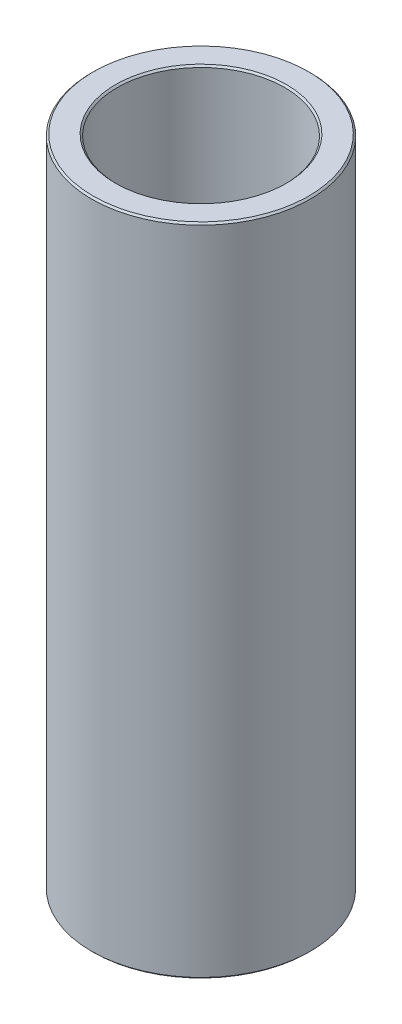
ISO-10303-21;
HEADER;
FILE_DESCRIPTION(('STEP AP214'),'2;1');
FILE_NAME('part.step','',(''),(''),'','','');
FILE_SCHEMA(('AUTOMOTIVE_DESIGN { 1 0 10303 214 1 1 1 1 }'));
ENDSEC;
DATA;
#1=APPLICATION_CONTEXT('core data for automotive mechanical design processes');
#2=APPLICATION_PROTOCOL_DEFINITION('international standard','automotive_design',2000,#1);
#3=PRODUCT_CONTEXT('',#1,'mechanical');
#4=PRODUCT('Part','Part','',(#3));
#5=PRODUCT_RELATED_PRODUCT_CATEGORY('part','',(#4));
#6=PRODUCT_DEFINITION_FORMATION('','',#4);
#7=PRODUCT_DEFINITION_CONTEXT('part definition',#1,'design');
#8=PRODUCT_DEFINITION('design','',#6,#7);
#9=PRODUCT_DEFINITION_SHAPE('','',#8);
#10=(LENGTH_UNIT() NAMED_UNIT(*) SI_UNIT(.MILLI.,.METRE.));
#11=(NAMED_UNIT(*) PLANE_ANGLE_UNIT() SI_UNIT($,.RADIAN.));
#12=(NAMED_UNIT(*) SI_UNIT($,.STERADIAN.) SOLID_ANGLE_UNIT());
#13=UNCERTAINTY_MEASURE_WITH_UNIT(LENGTH_MEASURE(1.E-05),#10,'distance_accuracy_value','');
#14=(GEOMETRIC_REPRESENTATION_CONTEXT(3) GLOBAL_UNCERTAINTY_ASSIGNED_CONTEXT((#13)) GLOBAL_UNIT_ASSIGNED_CONTEXT((#10,
#11,#12)) REPRESENTATION_CONTEXT('',''));
#15=CARTESIAN_POINT('',(0.,0.,0.));
#16=DIRECTION('',(0.,0.,1.));
#17=DIRECTION('',(1.,0.,0.));
#18=AXIS2_PLACEMENT_3D('',#15,#16,#17);
#19=CARTESIAN_POINT('',(0.,119.704415854471,0.));
#20=DIRECTION('',(0.,-1.,0.));
#21=DIRECTION('',(0.,0.,-1.));
#22=AXIS2_PLACEMENT_3D('',#19,#20,#21);
#23=CYLINDRICAL_SURFACE('',#22,20.);
#24=CARTESIAN_POINT('',(0.,0.311713244223147,0.));
#25=DIRECTION('',(0.,1.,0.));
#26=DIRECTION('',(0.,0.,1.));
#27=AXIS2_PLACEMENT_3D('',#24,#25,#26);
#28=CIRCLE('',#27,20.);
#29=CARTESIAN_POINT('',(0.,0.311713244223147,20.));
#30=VERTEX_POINT('',#29);
#31=EDGE_CURVE('E10',#30,#30,#28,.T.);
#32=ORIENTED_EDGE('',*,*,#31,.T.);
#33=EDGE_LOOP('',(#32));
#34=FACE_BOUND('',#33,.T.);
#35=CARTESIAN_POINT('',(0.,119.392702610247,0.));
#36=DIRECTION('',(0.,1.,0.));
#37=DIRECTION('',(0.,0.,1.));
#38=AXIS2_PLACEMENT_3D('',#35,#36,#37);
#39=CIRCLE('',#38,20.);
#40=CARTESIAN_POINT('',(0.,119.392702610247,20.));
#41=VERTEX_POINT('',#40);
#42=EDGE_CURVE('E50',#41,#41,#39,.F.);
#43=ORIENTED_EDGE('',*,*,#42,.T.);
#44=EDGE_LOOP('',(#43));
#45=FACE_BOUND('',#44,.T.);
#46=ADVANCED_FACE('F39',(#34,#45),#23,.T.);
#47=CARTESIAN_POINT('',(0.,119.704415854471,0.));
#48=DIRECTION('',(0.,1.,0.));
#49=DIRECTION('',(0.,0.,1.));
#50=AXIS2_PLACEMENT_3D('',#47,#48,#49);
#51=PLANE('',#50);
#52=CARTESIAN_POINT('',(0.,119.704415854471,0.));
#53=DIRECTION('',(0.,1.,0.));
#54=DIRECTION('',(0.,0.,1.));
#55=AXIS2_PLACEMENT_3D('',#52,#53,#54);
#56=CIRCLE('',#55,15.6331669486327);
#57=CARTESIAN_POINT('',(0.,119.704415854471,15.6331669486327));
#58=VERTEX_POINT('',#57);
#59=EDGE_CURVE('E58',#58,#58,#56,.F.);
#60=ORIENTED_EDGE('',*,*,#59,.T.);
#61=EDGE_LOOP('',(#60));
#62=FACE_BOUND('',#61,.T.);
#63=CARTESIAN_POINT('',(0.,119.704415854471,0.));
#64=DIRECTION('',(0.,1.,0.));
#65=DIRECTION('',(0.,0.,1.));
#66=AXIS2_PLACEMENT_3D('',#63,#64,#65);
#67=CIRCLE('',#66,19.6882867557768);
#68=CARTESIAN_POINT('',(0.,119.704415854471,19.6882867557768));
#69=VERTEX_POINT('',#68);
#70=EDGE_CURVE('E61',#69,#69,#67,.T.);
#71=ORIENTED_EDGE('',*,*,#70,.T.);
#72=EDGE_LOOP('',(#71));
#73=FACE_BOUND('',#72,.T.);
#74=ADVANCED_FACE('F88',(#62,#73),#51,.T.);
#75=CARTESIAN_POINT('',(0.,0.,0.));
#76=DIRECTION('',(0.,1.,0.));
#77=DIRECTION('',(0.,0.,1.));
#78=AXIS2_PLACEMENT_3D('',#75,#76,#77);
#79=PLANE('',#78);
#80=CARTESIAN_POINT('',(0.,0.,0.));
#81=DIRECTION('',(0.,1.,0.));
#82=DIRECTION('',(0.,0.,1.));
#83=AXIS2_PLACEMENT_3D('',#80,#81,#82);
#84=CIRCLE('',#83,15.6331669486327);
#85=CARTESIAN_POINT('',(0.,0.,15.6331669486327));
#86=VERTEX_POINT('',#85);
#87=EDGE_CURVE('E51',#86,#86,#84,.T.);
#88=ORIENTED_EDGE('',*,*,#87,.T.);
#89=EDGE_LOOP('',(#88));
#90=FACE_BOUND('',#89,.T.);
#91=CARTESIAN_POINT('',(0.,0.,0.));
#92=DIRECTION('',(0.,1.,0.));
#93=DIRECTION('',(0.,0.,1.));
#94=AXIS2_PLACEMENT_3D('',#91,#92,#93);
#95=CIRCLE('',#94,19.6882867557768);
#96=CARTESIAN_POINT('',(0.,0.,19.6882867557768));
#97=VERTEX_POINT('',#96);
#98=EDGE_CURVE('E54',#97,#97,#95,.F.);
#99=ORIENTED_EDGE('',*,*,#98,.T.);
#100=EDGE_LOOP('',(#99));
#101=FACE_BOUND('',#100,.T.);
#102=ADVANCED_FACE('F83',(#90,#101),#79,.F.);
#103=CARTESIAN_POINT('',(0.,119.704415854471,0.));
#104=DIRECTION('',(0.,-1.,0.));
#105=DIRECTION('',(0.,0.,-1.));
#106=AXIS2_PLACEMENT_3D('',#103,#104,#105);
#107=CYLINDRICAL_SURFACE('',#106,15.3214537044096);
#108=CARTESIAN_POINT('',(0.,119.392702610247,0.));
#109=DIRECTION('',(0.,1.,0.));
#110=DIRECTION('',(0.,0.,1.));
#111=AXIS2_PLACEMENT_3D('',#108,#109,#110);
#112=CIRCLE('',#111,15.3214537044096);
#113=CARTESIAN_POINT('',(0.,119.392702610247,15.3214537044096));
#114=VERTEX_POINT('',#113);
#115=EDGE_CURVE('E67',#114,#114,#112,.T.);
#116=ORIENTED_EDGE('',*,*,#115,.T.);
#117=EDGE_LOOP('',(#116));
#118=FACE_BOUND('',#117,.T.);
#119=CARTESIAN_POINT('',(0.,0.311713244223175,0.));
#120=DIRECTION('',(0.,1.,0.));
#121=DIRECTION('',(0.,0.,1.));
#122=AXIS2_PLACEMENT_3D('',#119,#120,#121);
#123=CIRCLE('',#122,15.3214537044096);
#124=CARTESIAN_POINT('',(0.,0.311713244223175,15.3214537044096));
#125=VERTEX_POINT('',#124);
#126=EDGE_CURVE('E69',#125,#125,#123,.F.);
#127=ORIENTED_EDGE('',*,*,#126,.T.);
#128=EDGE_LOOP('',(#127));
#129=FACE_BOUND('',#128,.T.);
#130=ADVANCED_FACE('F71',(#118,#129),#107,.F.);
#131=CARTESIAN_POINT('',(0.,119.392702610247,0.));
#132=DIRECTION('',(0.,1.,0.));
#133=DIRECTION('',(0.,0.,1.));
#134=AXIS2_PLACEMENT_3D('',#131,#132,#133);
#135=CONICAL_SURFACE('',#134,15.3214537044096,0.785398163397459);
#136=ORIENTED_EDGE('',*,*,#59,.F.);
#137=EDGE_LOOP('',(#136));
#138=FACE_BOUND('',#137,.T.);
#139=ORIENTED_EDGE('',*,*,#115,.F.);
#140=EDGE_LOOP('',(#139));
#141=FACE_BOUND('',#140,.T.);
#142=ADVANCED_FACE('F77',(#138,#141),#135,.F.);
#143=CARTESIAN_POINT('',(0.,0.,0.));
#144=DIRECTION('',(0.,-1.,0.));
#145=DIRECTION('',(0.,0.,-1.));
#146=AXIS2_PLACEMENT_3D('',#143,#144,#145);
#147=CONICAL_SURFACE('',#146,15.6331669486327,0.785398163397437);
#148=ORIENTED_EDGE('',*,*,#126,.F.);
#149=EDGE_LOOP('',(#148));
#150=FACE_BOUND('',#149,.T.);
#151=ORIENTED_EDGE('',*,*,#87,.F.);
#152=EDGE_LOOP('',(#151));
#153=FACE_BOUND('',#152,.T.);
#154=ADVANCED_FACE('F73',(#150,#153),#147,.F.);
#155=CARTESIAN_POINT('',(0.,0.311713244223147,0.));
#156=DIRECTION('',(0.,1.,0.));
#157=DIRECTION('',(0.,0.,1.));
#158=AXIS2_PLACEMENT_3D('',#155,#156,#157);
#159=CONICAL_SURFACE('',#158,20.,0.785398163397465);
#160=CARTESIAN_POINT('',(0.,0.,19.6882867557768));
#161=CARTESIAN_POINT('',(0.,0.00324701296065687,19.6915337687375));
#162=CARTESIAN_POINT('',(0.,0.00649402592131494,19.6947807816982));
#163=CARTESIAN_POINT('',(0.,0.0129880518426311,19.7012748076195));
#164=CARTESIAN_POINT('',(0.,0.0162350648032891,19.7045218205801));
#165=CARTESIAN_POINT('',(0.,0.0227290907246047,19.7110158465014));
#166=CARTESIAN_POINT('',(0.,0.0259761036852622,19.7142628594621));
#167=CARTESIAN_POINT('',(0.,0.0324701296065777,19.7207568853834));
#168=CARTESIAN_POINT('',(0.,0.0357171425672356,19.7240038983441));
#169=CARTESIAN_POINT('',(0.,0.042211168488551,19.7304979242654));
#170=CARTESIAN_POINT('',(0.,0.0454581814492085,19.7337449372261));
#171=CARTESIAN_POINT('',(0.,0.0519522073705242,19.7402389631474));
#172=CARTESIAN_POINT('',(0.,0.0551992203311824,19.743485976108));
#173=CARTESIAN_POINT('',(0.,0.0616932462524981,19.7499800020293));
#174=CARTESIAN_POINT('',(0.,0.0649402592131557,19.75322701499));
#175=CARTESIAN_POINT('',(0.,0.0714342851344709,19.7597210409113));
#176=CARTESIAN_POINT('',(0.,0.0746812980951285,19.762968053872));
#177=CARTESIAN_POINT('',(0.,0.0811753240164442,19.7694620797933));
#178=CARTESIAN_POINT('',(0.,0.0844223369771024,19.7727090927539));
#179=CARTESIAN_POINT('',(0.,0.0909163628984181,19.7792031186753));
#180=CARTESIAN_POINT('',(0.,0.0941633758590756,19.7824501316359));
#181=CARTESIAN_POINT('',(0.,0.100657401780391,19.7889441575572));
#182=CARTESIAN_POINT('',(0.,0.103904414741049,19.7921911705179));
#183=CARTESIAN_POINT('',(0.,0.110398440662364,19.7986851964392));
#184=CARTESIAN_POINT('',(0.,0.113645453623022,19.8019322093999));
#185=CARTESIAN_POINT('',(0.,0.120139479544338,19.8084262353212));
#186=CARTESIAN_POINT('',(0.,0.123386492504996,19.8116732482818));
#187=CARTESIAN_POINT('',(0.,0.129880518426312,19.8181672742032));
#188=CARTESIAN_POINT('',(0.,0.133127531386969,19.8214142871638));
#189=CARTESIAN_POINT('',(0.,0.139621557308284,19.8279083130851));
#190=CARTESIAN_POINT('',(0.,0.142868570268942,19.8311553260458));
#191=CARTESIAN_POINT('',(0.,0.149362596190258,19.8376493519671));
#192=CARTESIAN_POINT('',(0.,0.152609609150916,19.8408963649278));
#193=CARTESIAN_POINT('',(0.,0.159103635072231,19.8473903908491));
#194=CARTESIAN_POINT('',(0.,0.162350648032889,19.8506374038097));
#195=CARTESIAN_POINT('',(0.,0.168844673954204,19.8571314297311));
#196=CARTESIAN_POINT('',(0.,0.172091686914862,19.8603784426917));
#197=CARTESIAN_POINT('',(0.,0.178585712836178,19.866872468613));
#198=CARTESIAN_POINT('',(0.,0.181832725796835,19.8701194815737));
#199=CARTESIAN_POINT('',(0.,0.188326751718151,19.876613507495));
#200=CARTESIAN_POINT('',(0.,0.191573764678809,19.8798605204557));
#201=CARTESIAN_POINT('',(0.,0.198067790600125,19.886354546377));
#202=CARTESIAN_POINT('',(0.,0.201314803560782,19.8896015593376));
#203=CARTESIAN_POINT('',(0.,0.207808829482098,19.8960955852589));
#204=CARTESIAN_POINT('',(0.,0.211055842442756,19.8993425982196));
#205=CARTESIAN_POINT('',(0.,0.217549868364071,19.9058366241409));
#206=CARTESIAN_POINT('',(0.,0.220796881324729,19.9090836371016));
#207=CARTESIAN_POINT('',(0.,0.227290907246044,19.9155776630229));
#208=CARTESIAN_POINT('',(0.,0.230537920206702,19.9188246759836));
#209=CARTESIAN_POINT('',(0.,0.237031946128018,19.9253187019049));
#210=CARTESIAN_POINT('',(0.,0.240278959088676,19.9285657148655));
#211=CARTESIAN_POINT('',(0.,0.246772985009991,19.9350597407868));
#212=CARTESIAN_POINT('',(0.,0.250019997970649,19.9383067537475));
#213=CARTESIAN_POINT('',(0.,0.256514023891964,19.9448007796688));
#214=CARTESIAN_POINT('',(0.,0.259761036852623,19.9480477926295));
#215=CARTESIAN_POINT('',(0.,0.266255062773938,19.9545418185508));
#216=CARTESIAN_POINT('',(0.,0.269502075734596,19.9577888315114));
#217=CARTESIAN_POINT('',(0.,0.275996101655911,19.9642828574328));
#218=CARTESIAN_POINT('',(0.,0.279243114616569,19.9675298703934));
#219=CARTESIAN_POINT('',(0.,0.285737140537885,19.9740238963147));
#220=CARTESIAN_POINT('',(0.,0.288984153498542,19.9772709092754));
#221=CARTESIAN_POINT('',(0.,0.295478179419858,19.9837649351967));
#222=CARTESIAN_POINT('',(0.,0.298725192380516,19.9870119481574));
#223=CARTESIAN_POINT('',(0.,0.305219218301832,19.9935059740787));
#224=CARTESIAN_POINT('',(0.,0.30846623126249,19.9967529870393));
#225=CARTESIAN_POINT('',(0.,0.311713244223147,20.));
#226=B_SPLINE_CURVE_WITH_KNOTS('',3,(#160,#161,#162,#163,#164,#165,#166,#167,#168,#169,#170,
#171,#172,#173,#174,#175,#176,#177,#178,#179,#180,#181,#182,#183,#184,#185,#186,#187,#188,#189,
#190,#191,#192,#193,#194,#195,#196,#197,#198,#199,#200,#201,#202,#203,#204,#205,#206,#207,#208,
#209,#210,#211,#212,#213,#214,#215,#216,#217,#218,#219,#220,#221,#222,#223,#224,#225),
.UNSPECIFIED.,.F.,.F.,(4,2,2,2,2,2,2,2,2,2,2,2,2,2,2,2,2,2,2,2,2,2,2,2,2,2,2,2,2,2,2,2,4),(0.,
0.0137759092984913,0.0275518185969801,0.0413277278954713,0.0551036371939626,0.0688795464924539,
0.0826554557909427,0.0964313650894339,0.110207274387925,0.123983183686414,0.137759092984905,
0.151535002283397,0.165310911581888,0.179086820880377,0.192862730178868,0.206638639477359,
0.220414548775848,0.234190458074339,0.247966367372831,0.261742276671322,0.275518185969811,
0.289294095268302,0.303070004566793,0.316845913865284,0.330621823163773,0.344397732462264,
0.358173641760756,0.371949551059245,0.385725460357736,0.399501369656227,0.413277278954718,
0.427053188253207,0.440829097551698),.UNSPECIFIED.);
#227=EDGE_CURVE('BSEAM76',#97,#30,#226,.T.);
#228=ORIENTED_EDGE('',*,*,#98,.F.);
#229=ORIENTED_EDGE('',*,*,#31,.F.);
#230=ORIENTED_EDGE('',*,*,#227,.T.);
#231=ORIENTED_EDGE('',*,*,#227,.F.);
#232=EDGE_LOOP('',(#228,#230,#229,#231));
#233=FACE_BOUND('',#232,.T.);
#234=ADVANCED_FACE('F76',(#233),#159,.T.);
#235=CARTESIAN_POINT('',(0.,119.704415854471,0.));
#236=DIRECTION('',(0.,-1.,0.));
#237=DIRECTION('',(0.,0.,-1.));
#238=AXIS2_PLACEMENT_3D('',#235,#236,#237);
#239=CONICAL_SURFACE('',#238,19.6882867557768,0.785398163397443);
#240=ORIENTED_EDGE('',*,*,#42,.F.);
#241=EDGE_LOOP('',(#240));
#242=FACE_BOUND('',#241,.T.);
#243=ORIENTED_EDGE('',*,*,#70,.F.);
#244=EDGE_LOOP('',(#243));
#245=FACE_BOUND('',#244,.T.);
#246=ADVANCED_FACE('F45',(#242,#245),#239,.T.);
#247=CLOSED_SHELL('',(#46,#74,#102,#130,#142,#154,#234,#246));
#248=MANIFOLD_SOLID_BREP('B2',#247);
#249=ADVANCED_BREP_SHAPE_REPRESENTATION('',(#18,#248),#14);
#250=SHAPE_DEFINITION_REPRESENTATION(#9,#249);
ENDSEC;
END-ISO-10303-21;
